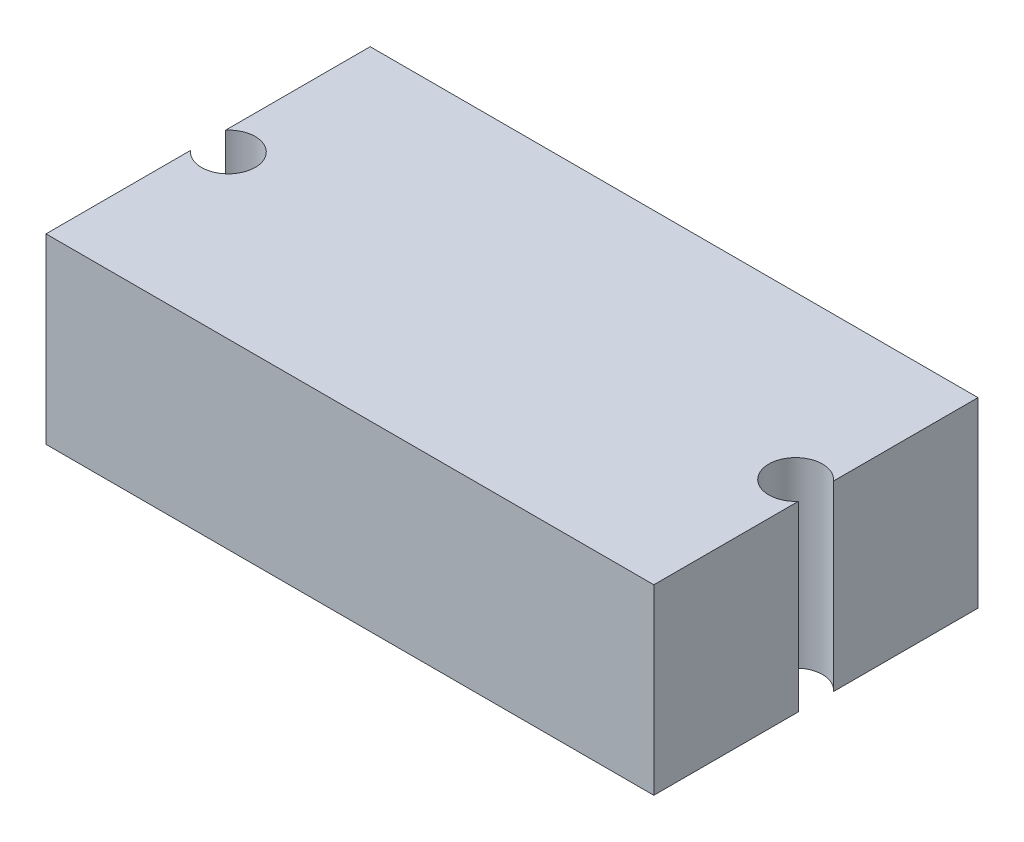
ISO-10303-21;
HEADER;
FILE_DESCRIPTION(('STEP AP214'),'2;1');
FILE_NAME('part.step','',(''),(''),'','','');
FILE_SCHEMA(('AUTOMOTIVE_DESIGN { 1 0 10303 214 1 1 1 1 }'));
ENDSEC;
DATA;
#1=APPLICATION_CONTEXT('core data for automotive mechanical design processes');
#2=APPLICATION_PROTOCOL_DEFINITION('international standard','automotive_design',2000,#1);
#3=PRODUCT_CONTEXT('',#1,'mechanical');
#4=PRODUCT('Part','Part','',(#3));
#5=PRODUCT_RELATED_PRODUCT_CATEGORY('part','',(#4));
#6=PRODUCT_DEFINITION_FORMATION('','',#4);
#7=PRODUCT_DEFINITION_CONTEXT('part definition',#1,'design');
#8=PRODUCT_DEFINITION('design','',#6,#7);
#9=PRODUCT_DEFINITION_SHAPE('','',#8);
#10=(LENGTH_UNIT() NAMED_UNIT(*) SI_UNIT(.MILLI.,.METRE.));
#11=(NAMED_UNIT(*) PLANE_ANGLE_UNIT() SI_UNIT($,.RADIAN.));
#12=(NAMED_UNIT(*) SI_UNIT($,.STERADIAN.) SOLID_ANGLE_UNIT());
#13=UNCERTAINTY_MEASURE_WITH_UNIT(LENGTH_MEASURE(1.E-05),#10,'distance_accuracy_value','');
#14=(GEOMETRIC_REPRESENTATION_CONTEXT(3) GLOBAL_UNCERTAINTY_ASSIGNED_CONTEXT((#13)) GLOBAL_UNIT_ASSIGNED_CONTEXT((#10,
#11,#12)) REPRESENTATION_CONTEXT('',''));
#15=CARTESIAN_POINT('',(0.,0.,0.));
#16=DIRECTION('',(0.,0.,1.));
#17=DIRECTION('',(1.,0.,0.));
#18=AXIS2_PLACEMENT_3D('',#15,#16,#17);
#19=CARTESIAN_POINT('',(30.,18.,-16.));
#20=DIRECTION('',(-1.,0.,0.));
#21=DIRECTION('',(0.,0.,1.));
#22=AXIS2_PLACEMENT_3D('',#19,#20,#21);
#23=PLANE('',#22);
#24=DIRECTION('',(0.,0.,-1.));
#25=VECTOR('',#24,1.);
#26=CARTESIAN_POINT('',(30.,0.,-16.));
#27=LINE('',#26,#25);
#28=CARTESIAN_POINT('',(30.,0.,16.));
#29=VERTEX_POINT('',#28);
#30=CARTESIAN_POINT('',(30.,0.,1.73853386507136));
#31=VERTEX_POINT('',#30);
#32=EDGE_CURVE('E118',#29,#31,#27,.T.);
#33=ORIENTED_EDGE('',*,*,#32,.T.);
#34=DIRECTION('',(0.,1.,0.));
#35=VECTOR('',#34,1.);
#36=CARTESIAN_POINT('',(30.,0.,1.73853386507136));
#37=LINE('',#36,#35);
#38=CARTESIAN_POINT('',(30.,18.,1.73853386507136));
#39=VERTEX_POINT('',#38);
#40=EDGE_CURVE('E57',#31,#39,#37,.T.);
#41=ORIENTED_EDGE('',*,*,#40,.T.);
#42=DIRECTION('',(0.,0.,-1.));
#43=VECTOR('',#42,1.);
#44=CARTESIAN_POINT('',(30.,18.,-16.));
#45=LINE('',#44,#43);
#46=CARTESIAN_POINT('',(30.,18.,16.));
#47=VERTEX_POINT('',#46);
#48=EDGE_CURVE('E151',#47,#39,#45,.T.);
#49=ORIENTED_EDGE('',*,*,#48,.F.);
#50=DIRECTION('',(0.,-1.,0.));
#51=VECTOR('',#50,1.);
#52=CARTESIAN_POINT('',(30.,18.,16.));
#53=LINE('',#52,#51);
#54=EDGE_CURVE('E133',#47,#29,#53,.T.);
#55=ORIENTED_EDGE('',*,*,#54,.T.);
#56=EDGE_LOOP('',(#33,#41,#49,#55));
#57=FACE_BOUND('',#56,.T.);
#58=ADVANCED_FACE('F35',(#57),#23,.F.);
#59=CARTESIAN_POINT('',(-30.,18.,-16.));
#60=DIRECTION('',(1.,0.,0.));
#61=DIRECTION('',(0.,0.,-1.));
#62=AXIS2_PLACEMENT_3D('',#59,#60,#61);
#63=PLANE('',#62);
#64=DIRECTION('',(0.,0.,1.));
#65=VECTOR('',#64,1.);
#66=CARTESIAN_POINT('',(-30.,0.,-16.));
#67=LINE('',#66,#65);
#68=CARTESIAN_POINT('',(-30.,0.,-16.));
#69=VERTEX_POINT('',#68);
#70=CARTESIAN_POINT('',(-30.,0.,-1.73853386507137));
#71=VERTEX_POINT('',#70);
#72=EDGE_CURVE('E128',#69,#71,#67,.T.);
#73=ORIENTED_EDGE('',*,*,#72,.T.);
#74=DIRECTION('',(0.,1.,0.));
#75=VECTOR('',#74,1.);
#76=CARTESIAN_POINT('',(-30.,0.,-1.73853386507137));
#77=LINE('',#76,#75);
#78=CARTESIAN_POINT('',(-30.,18.,-1.73853386507137));
#79=VERTEX_POINT('',#78);
#80=EDGE_CURVE('E50',#71,#79,#77,.T.);
#81=ORIENTED_EDGE('',*,*,#80,.T.);
#82=DIRECTION('',(0.,0.,1.));
#83=VECTOR('',#82,1.);
#84=CARTESIAN_POINT('',(-30.,18.,-16.));
#85=LINE('',#84,#83);
#86=CARTESIAN_POINT('',(-30.,18.,-16.));
#87=VERTEX_POINT('',#86);
#88=EDGE_CURVE('E153',#87,#79,#85,.T.);
#89=ORIENTED_EDGE('',*,*,#88,.F.);
#90=DIRECTION('',(0.,-1.,0.));
#91=VECTOR('',#90,1.);
#92=CARTESIAN_POINT('',(-30.,18.,-16.));
#93=LINE('',#92,#91);
#94=EDGE_CURVE('E139',#87,#69,#93,.T.);
#95=ORIENTED_EDGE('',*,*,#94,.T.);
#96=EDGE_LOOP('',(#73,#81,#89,#95));
#97=FACE_BOUND('',#96,.T.);
#98=ADVANCED_FACE('F175',(#97),#63,.F.);
#99=CARTESIAN_POINT('',(30.,18.,-1.73853386507138));
#100=VERTEX_POINT('',#99);
#101=CARTESIAN_POINT('',(30.,18.,-16.));
#102=VERTEX_POINT('',#101);
#103=EDGE_CURVE('E110',#100,#102,#45,.T.);
#104=ORIENTED_EDGE('',*,*,#103,.F.);
#105=DIRECTION('',(0.,1.,0.));
#106=VECTOR('',#105,1.);
#107=CARTESIAN_POINT('',(30.,0.,-1.73853386507138));
#108=LINE('',#107,#106);
#109=CARTESIAN_POINT('',(30.,0.,-1.73853386507138));
#110=VERTEX_POINT('',#109);
#111=EDGE_CURVE('E98',#100,#110,#108,.F.);
#112=ORIENTED_EDGE('',*,*,#111,.T.);
#113=CARTESIAN_POINT('',(30.,0.,-16.));
#114=VERTEX_POINT('',#113);
#115=EDGE_CURVE('E108',#110,#114,#27,.T.);
#116=ORIENTED_EDGE('',*,*,#115,.T.);
#117=DIRECTION('',(0.,-1.,0.));
#118=VECTOR('',#117,1.);
#119=CARTESIAN_POINT('',(30.,18.,-16.));
#120=LINE('',#119,#118);
#121=EDGE_CURVE('E104',#102,#114,#120,.T.);
#122=ORIENTED_EDGE('',*,*,#121,.F.);
#123=EDGE_LOOP('',(#104,#112,#116,#122));
#124=FACE_BOUND('',#123,.T.);
#125=ADVANCED_FACE('F37',(#124),#23,.F.);
#126=CARTESIAN_POINT('',(-30.,18.,-16.));
#127=DIRECTION('',(0.,0.,1.));
#128=DIRECTION('',(1.,0.,0.));
#129=AXIS2_PLACEMENT_3D('',#126,#127,#128);
#130=PLANE('',#129);
#131=DIRECTION('',(-1.,0.,0.));
#132=VECTOR('',#131,1.);
#133=CARTESIAN_POINT('',(-30.,0.,-16.));
#134=LINE('',#133,#132);
#135=EDGE_CURVE('E116',#114,#69,#134,.T.);
#136=ORIENTED_EDGE('',*,*,#135,.T.);
#137=ORIENTED_EDGE('',*,*,#94,.F.);
#138=DIRECTION('',(-1.,0.,0.));
#139=VECTOR('',#138,1.);
#140=CARTESIAN_POINT('',(-30.,18.,-16.));
#141=LINE('',#140,#139);
#142=EDGE_CURVE('E146',#102,#87,#141,.T.);
#143=ORIENTED_EDGE('',*,*,#142,.F.);
#144=ORIENTED_EDGE('',*,*,#121,.T.);
#145=EDGE_LOOP('',(#136,#137,#143,#144));
#146=FACE_BOUND('',#145,.T.);
#147=ADVANCED_FACE('F144',(#146),#130,.F.);
#148=CARTESIAN_POINT('',(-30.,18.,1.73853386507137));
#149=VERTEX_POINT('',#148);
#150=CARTESIAN_POINT('',(-30.,18.,16.));
#151=VERTEX_POINT('',#150);
#152=EDGE_CURVE('E150',#149,#151,#85,.T.);
#153=ORIENTED_EDGE('',*,*,#152,.F.);
#154=DIRECTION('',(0.,1.,0.));
#155=VECTOR('',#154,1.);
#156=CARTESIAN_POINT('',(-30.,0.,1.73853386507137));
#157=LINE('',#156,#155);
#158=CARTESIAN_POINT('',(-30.,0.,1.73853386507137));
#159=VERTEX_POINT('',#158);
#160=EDGE_CURVE('E120',#149,#159,#157,.F.);
#161=ORIENTED_EDGE('',*,*,#160,.T.);
#162=CARTESIAN_POINT('',(-30.,0.,16.));
#163=VERTEX_POINT('',#162);
#164=EDGE_CURVE('E127',#159,#163,#67,.T.);
#165=ORIENTED_EDGE('',*,*,#164,.T.);
#166=DIRECTION('',(0.,-1.,0.));
#167=VECTOR('',#166,1.);
#168=CARTESIAN_POINT('',(-30.,18.,16.));
#169=LINE('',#168,#167);
#170=EDGE_CURVE('E136',#151,#163,#169,.T.);
#171=ORIENTED_EDGE('',*,*,#170,.F.);
#172=EDGE_LOOP('',(#153,#161,#165,#171));
#173=FACE_BOUND('',#172,.T.);
#174=ADVANCED_FACE('F177',(#173),#63,.F.);
#175=CARTESIAN_POINT('',(-30.,18.,16.));
#176=DIRECTION('',(0.,0.,-1.));
#177=DIRECTION('',(-1.,0.,0.));
#178=AXIS2_PLACEMENT_3D('',#175,#176,#177);
#179=PLANE('',#178);
#180=DIRECTION('',(1.,0.,0.));
#181=VECTOR('',#180,1.);
#182=CARTESIAN_POINT('',(-30.,0.,16.));
#183=LINE('',#182,#181);
#184=EDGE_CURVE('E131',#163,#29,#183,.T.);
#185=ORIENTED_EDGE('',*,*,#184,.T.);
#186=ORIENTED_EDGE('',*,*,#54,.F.);
#187=DIRECTION('',(1.,0.,0.));
#188=VECTOR('',#187,1.);
#189=CARTESIAN_POINT('',(-30.,18.,16.));
#190=LINE('',#189,#188);
#191=EDGE_CURVE('E124',#151,#47,#190,.T.);
#192=ORIENTED_EDGE('',*,*,#191,.F.);
#193=ORIENTED_EDGE('',*,*,#170,.T.);
#194=EDGE_LOOP('',(#185,#186,#192,#193));
#195=FACE_BOUND('',#194,.T.);
#196=ADVANCED_FACE('F164',(#195),#179,.F.);
#197=CARTESIAN_POINT('',(0.,18.,0.));
#198=DIRECTION('',(0.,1.,0.));
#199=DIRECTION('',(0.,0.,1.));
#200=AXIS2_PLACEMENT_3D('',#197,#198,#199);
#201=PLANE('',#200);
#202=CARTESIAN_POINT('',(-28.,18.,0.));
#203=DIRECTION('',(0.,1.,0.));
#204=DIRECTION('',(0.,0.,1.));
#205=AXIS2_PLACEMENT_3D('',#202,#203,#204);
#206=CIRCLE('',#205,2.65);
#207=EDGE_CURVE('E111',#149,#79,#206,.T.);
#208=ORIENTED_EDGE('',*,*,#207,.F.);
#209=ORIENTED_EDGE('',*,*,#152,.T.);
#210=ORIENTED_EDGE('',*,*,#191,.T.);
#211=ORIENTED_EDGE('',*,*,#48,.T.);
#212=CARTESIAN_POINT('',(28.,18.,0.));
#213=DIRECTION('',(0.,1.,0.));
#214=DIRECTION('',(0.,0.,1.));
#215=AXIS2_PLACEMENT_3D('',#212,#213,#214);
#216=CIRCLE('',#215,2.65);
#217=EDGE_CURVE('E171',#100,#39,#216,.T.);
#218=ORIENTED_EDGE('',*,*,#217,.F.);
#219=ORIENTED_EDGE('',*,*,#103,.T.);
#220=ORIENTED_EDGE('',*,*,#142,.T.);
#221=ORIENTED_EDGE('',*,*,#88,.T.);
#222=EDGE_LOOP('',(#208,#209,#210,#211,#218,#219,#220,#221));
#223=FACE_BOUND('',#222,.T.);
#224=ADVANCED_FACE('F159',(#223),#201,.T.);
#225=CARTESIAN_POINT('',(0.,0.,0.));
#226=DIRECTION('',(0.,1.,0.));
#227=DIRECTION('',(0.,0.,1.));
#228=AXIS2_PLACEMENT_3D('',#225,#226,#227);
#229=PLANE('',#228);
#230=ORIENTED_EDGE('',*,*,#164,.F.);
#231=CARTESIAN_POINT('',(-28.,0.,0.));
#232=DIRECTION('',(0.,1.,0.));
#233=DIRECTION('',(0.,0.,1.));
#234=AXIS2_PLACEMENT_3D('',#231,#232,#233);
#235=CIRCLE('',#234,2.65);
#236=EDGE_CURVE('E11',#159,#71,#235,.T.);
#237=ORIENTED_EDGE('',*,*,#236,.T.);
#238=ORIENTED_EDGE('',*,*,#72,.F.);
#239=ORIENTED_EDGE('',*,*,#135,.F.);
#240=ORIENTED_EDGE('',*,*,#115,.F.);
#241=CARTESIAN_POINT('',(28.,0.,0.));
#242=DIRECTION('',(0.,1.,0.));
#243=DIRECTION('',(0.,0.,1.));
#244=AXIS2_PLACEMENT_3D('',#241,#242,#243);
#245=CIRCLE('',#244,2.65);
#246=EDGE_CURVE('E43',#110,#31,#245,.T.);
#247=ORIENTED_EDGE('',*,*,#246,.T.);
#248=ORIENTED_EDGE('',*,*,#32,.F.);
#249=ORIENTED_EDGE('',*,*,#184,.F.);
#250=EDGE_LOOP('',(#230,#237,#238,#239,#240,#247,#248,#249));
#251=FACE_BOUND('',#250,.T.);
#252=ADVANCED_FACE('F114',(#251),#229,.F.);
#253=CARTESIAN_POINT('',(28.,0.,0.));
#254=DIRECTION('',(0.,1.,0.));
#255=DIRECTION('',(0.,0.,1.));
#256=AXIS2_PLACEMENT_3D('',#253,#254,#255);
#257=CYLINDRICAL_SURFACE('',#256,2.65);
#258=ORIENTED_EDGE('',*,*,#246,.F.);
#259=ORIENTED_EDGE('',*,*,#111,.F.);
#260=ORIENTED_EDGE('',*,*,#217,.T.);
#261=ORIENTED_EDGE('',*,*,#40,.F.);
#262=EDGE_LOOP('',(#258,#259,#260,#261));
#263=FACE_BOUND('',#262,.T.);
#264=ADVANCED_FACE('F97',(#263),#257,.F.);
#265=CARTESIAN_POINT('',(-28.,0.,0.));
#266=DIRECTION('',(0.,1.,0.));
#267=DIRECTION('',(0.,0.,1.));
#268=AXIS2_PLACEMENT_3D('',#265,#266,#267);
#269=CYLINDRICAL_SURFACE('',#268,2.65);
#270=ORIENTED_EDGE('',*,*,#236,.F.);
#271=ORIENTED_EDGE('',*,*,#160,.F.);
#272=ORIENTED_EDGE('',*,*,#207,.T.);
#273=ORIENTED_EDGE('',*,*,#80,.F.);
#274=EDGE_LOOP('',(#270,#271,#272,#273));
#275=FACE_BOUND('',#274,.T.);
#276=ADVANCED_FACE('F173',(#275),#269,.F.);
#277=CLOSED_SHELL('',(#58,#98,#125,#147,#174,#196,#224,#252,#264,#276));
#278=MANIFOLD_SOLID_BREP('B2',#277);
#279=ADVANCED_BREP_SHAPE_REPRESENTATION('',(#18,#278),#14);
#280=SHAPE_DEFINITION_REPRESENTATION(#9,#279);
ENDSEC;
END-ISO-10303-21;
